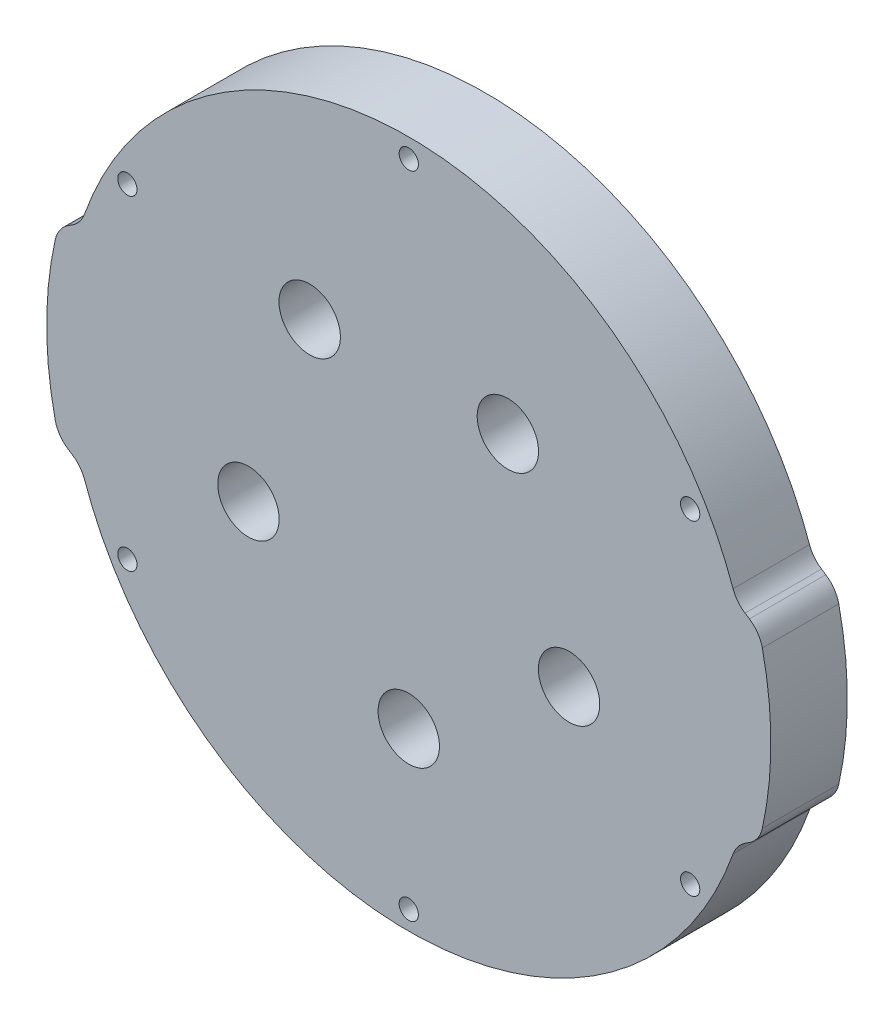
ISO-10303-21;
HEADER;
FILE_DESCRIPTION(('STEP AP214'),'2;1');
FILE_NAME('part.step','',(''),(''),'','','');
FILE_SCHEMA(('AUTOMOTIVE_DESIGN { 1 0 10303 214 1 1 1 1 }'));
ENDSEC;
DATA;
#1=APPLICATION_CONTEXT('core data for automotive mechanical design processes');
#2=APPLICATION_PROTOCOL_DEFINITION('international standard','automotive_design',2000,#1);
#3=PRODUCT_CONTEXT('',#1,'mechanical');
#4=PRODUCT('Part','Part','',(#3));
#5=PRODUCT_RELATED_PRODUCT_CATEGORY('part','',(#4));
#6=PRODUCT_DEFINITION_FORMATION('','',#4);
#7=PRODUCT_DEFINITION_CONTEXT('part definition',#1,'design');
#8=PRODUCT_DEFINITION('design','',#6,#7);
#9=PRODUCT_DEFINITION_SHAPE('','',#8);
#10=(LENGTH_UNIT() NAMED_UNIT(*) SI_UNIT(.MILLI.,.METRE.));
#11=(NAMED_UNIT(*) PLANE_ANGLE_UNIT() SI_UNIT($,.RADIAN.));
#12=(NAMED_UNIT(*) SI_UNIT($,.STERADIAN.) SOLID_ANGLE_UNIT());
#13=UNCERTAINTY_MEASURE_WITH_UNIT(LENGTH_MEASURE(1.E-05),#10,'distance_accuracy_value','');
#14=(GEOMETRIC_REPRESENTATION_CONTEXT(3) GLOBAL_UNCERTAINTY_ASSIGNED_CONTEXT((#13)) GLOBAL_UNIT_ASSIGNED_CONTEXT((#10,
#11,#12)) REPRESENTATION_CONTEXT('',''));
#15=CARTESIAN_POINT('',(0.,0.,0.));
#16=DIRECTION('',(0.,0.,1.));
#17=DIRECTION('',(1.,0.,0.));
#18=AXIS2_PLACEMENT_3D('',#15,#16,#17);
#19=CARTESIAN_POINT('',(0.,0.,12.7));
#20=DIRECTION('',(0.,0.,1.));
#21=DIRECTION('',(1.,0.,0.));
#22=AXIS2_PLACEMENT_3D('',#19,#20,#21);
#23=PLANE('',#22);
#24=CARTESIAN_POINT('',(0.,-28.,12.7));
#25=DIRECTION('',(0.,0.,-1.));
#26=DIRECTION('',(-1.,0.,0.));
#27=AXIS2_PLACEMENT_3D('',#24,#25,#26);
#28=CIRCLE('',#27,5.10000000000001);
#29=CARTESIAN_POINT('',(-5.10000000000001,-28.,12.7));
#30=VERTEX_POINT('',#29);
#31=EDGE_CURVE('E496',#30,#30,#28,.T.);
#32=ORIENTED_EDGE('',*,*,#31,.T.);
#33=EDGE_LOOP('',(#32));
#34=FACE_BOUND('',#33,.T.);
#35=CARTESIAN_POINT('',(16.4579870641893,22.6524758424985,12.7));
#36=DIRECTION('',(0.,0.,-1.));
#37=DIRECTION('',(-1.,0.,0.));
#38=AXIS2_PLACEMENT_3D('',#35,#36,#37);
#39=CIRCLE('',#38,5.1);
#40=CARTESIAN_POINT('',(11.3579870641893,22.6524758424985,12.7));
#41=VERTEX_POINT('',#40);
#42=EDGE_CURVE('E490',#41,#41,#39,.T.);
#43=ORIENTED_EDGE('',*,*,#42,.T.);
#44=EDGE_LOOP('',(#43));
#45=FACE_BOUND('',#44,.T.);
#46=CARTESIAN_POINT('',(-26.6295824562643,-8.65247584249852,12.7));
#47=DIRECTION('',(0.,0.,-1.));
#48=DIRECTION('',(-1.,0.,0.));
#49=AXIS2_PLACEMENT_3D('',#46,#47,#48);
#50=CIRCLE('',#49,5.1);
#51=CARTESIAN_POINT('',(-31.7295824562643,-8.65247584249852,12.7));
#52=VERTEX_POINT('',#51);
#53=EDGE_CURVE('E484',#52,#52,#50,.T.);
#54=ORIENTED_EDGE('',*,*,#53,.T.);
#55=EDGE_LOOP('',(#54));
#56=FACE_BOUND('',#55,.T.);
#57=CARTESIAN_POINT('',(26.6295824562643,-8.65247584249853,12.7));
#58=DIRECTION('',(0.,0.,-1.));
#59=DIRECTION('',(-1.,0.,0.));
#60=AXIS2_PLACEMENT_3D('',#57,#58,#59);
#61=CIRCLE('',#60,5.1);
#62=CARTESIAN_POINT('',(21.5295824562643,-8.65247584249853,12.7));
#63=VERTEX_POINT('',#62);
#64=EDGE_CURVE('E478',#63,#63,#61,.T.);
#65=ORIENTED_EDGE('',*,*,#64,.T.);
#66=EDGE_LOOP('',(#65));
#67=FACE_BOUND('',#66,.T.);
#68=CARTESIAN_POINT('',(-16.4579870641892,22.6524758424985,12.7));
#69=DIRECTION('',(0.,0.,-1.));
#70=DIRECTION('',(-1.,0.,0.));
#71=AXIS2_PLACEMENT_3D('',#68,#69,#70);
#72=CIRCLE('',#71,5.1);
#73=CARTESIAN_POINT('',(-21.5579870641892,22.6524758424985,12.7));
#74=VERTEX_POINT('',#73);
#75=EDGE_CURVE('E472',#74,#74,#72,.T.);
#76=ORIENTED_EDGE('',*,*,#75,.T.);
#77=EDGE_LOOP('',(#76));
#78=FACE_BOUND('',#77,.T.);
#79=CARTESIAN_POINT('',(4.05749188327836E-12,-53.9749999999976,12.7));
#80=DIRECTION('',(0.,0.,1.));
#81=DIRECTION('',(1.,0.,0.));
#82=AXIS2_PLACEMENT_3D('',#79,#80,#81);
#83=CIRCLE('',#82,1.6);
#84=CARTESIAN_POINT('',(1.60000000000406,-53.9749999999976,12.7));
#85=VERTEX_POINT('',#84);
#86=EDGE_CURVE('E460',#85,#85,#83,.T.);
#87=ORIENTED_EDGE('',*,*,#86,.F.);
#88=EDGE_LOOP('',(#87));
#89=FACE_BOUND('',#88,.T.);
#90=CARTESIAN_POINT('',(46.7437211692651,26.9875000000024,12.7));
#91=DIRECTION('',(0.,0.,1.));
#92=DIRECTION('',(1.,0.,0.));
#93=AXIS2_PLACEMENT_3D('',#90,#91,#92);
#94=CIRCLE('',#93,1.6);
#95=CARTESIAN_POINT('',(48.343721169265,26.9875000000024,12.7));
#96=VERTEX_POINT('',#95);
#97=EDGE_CURVE('E438',#96,#96,#94,.T.);
#98=ORIENTED_EDGE('',*,*,#97,.F.);
#99=EDGE_LOOP('',(#98));
#100=FACE_BOUND('',#99,.T.);
#101=CARTESIAN_POINT('',(0.,53.975,12.7));
#102=DIRECTION('',(0.,0.,1.));
#103=DIRECTION('',(1.,0.,0.));
#104=AXIS2_PLACEMENT_3D('',#101,#102,#103);
#105=CIRCLE('',#104,1.6);
#106=CARTESIAN_POINT('',(1.6,53.975,12.7));
#107=VERTEX_POINT('',#106);
#108=EDGE_CURVE('E253',#107,#107,#105,.T.);
#109=ORIENTED_EDGE('',*,*,#108,.F.);
#110=EDGE_LOOP('',(#109));
#111=FACE_BOUND('',#110,.T.);
#112=DIRECTION('',(0.83836541006885,0.545108648986685,0.));
#113=VECTOR('',#112,1.);
#114=CARTESIAN_POINT('',(54.4047102740195,-17.5,12.7));
#115=LINE('',#114,#113);
#116=CARTESIAN_POINT('',(55.8597455361239,-16.5539300686456,12.7));
#117=VERTEX_POINT('',#116);
#118=CARTESIAN_POINT('',(56.5773734681787,-16.0873254260645,12.7));
#119=VERTEX_POINT('',#118);
#120=EDGE_CURVE('E278',#117,#119,#115,.T.);
#121=ORIENTED_EDGE('',*,*,#120,.T.);
#122=CARTESIAN_POINT('',(53.8518302232453,-11.8954983757203,12.7));
#123=DIRECTION('',(0.,0.,1.));
#124=DIRECTION('',(1.,0.,0.));
#125=AXIS2_PLACEMENT_3D('',#122,#123,#124);
#126=CIRCLE('',#125,5.);
#127=CARTESIAN_POINT('',(58.7341357738568,-12.97396604351,12.7));
#128=VERTEX_POINT('',#127);
#129=EDGE_CURVE('E197',#119,#128,#126,.T.);
#130=ORIENTED_EDGE('',*,*,#129,.T.);
#131=CARTESIAN_POINT('',(0.,0.,12.7));
#132=DIRECTION('',(0.,0.,1.));
#133=DIRECTION('',(1.,0.,0.));
#134=AXIS2_PLACEMENT_3D('',#131,#132,#133);
#135=CIRCLE('',#134,60.15);
#136=CARTESIAN_POINT('',(58.7341357738568,12.97396604351,12.7));
#137=VERTEX_POINT('',#136);
#138=EDGE_CURVE('E167',#128,#137,#135,.T.);
#139=ORIENTED_EDGE('',*,*,#138,.T.);
#140=CARTESIAN_POINT('',(53.8518302232453,11.8954983757203,12.7));
#141=DIRECTION('',(0.,0.,1.));
#142=DIRECTION('',(1.,0.,0.));
#143=AXIS2_PLACEMENT_3D('',#140,#141,#142);
#144=CIRCLE('',#143,5.);
#145=CARTESIAN_POINT('',(56.5773734681787,16.0873254260645,12.7));
#146=VERTEX_POINT('',#145);
#147=EDGE_CURVE('E56',#137,#146,#144,.T.);
#148=ORIENTED_EDGE('',*,*,#147,.T.);
#149=DIRECTION('',(-0.83836541006885,0.545108648986684,0.));
#150=VECTOR('',#149,1.);
#151=CARTESIAN_POINT('',(54.4047102740195,17.5,12.7));
#152=LINE('',#151,#150);
#153=CARTESIAN_POINT('',(55.8597455361239,16.5539300686456,12.7));
#154=VERTEX_POINT('',#153);
#155=EDGE_CURVE('E183',#146,#154,#152,.T.);
#156=ORIENTED_EDGE('',*,*,#155,.T.);
#157=CARTESIAN_POINT('',(58.5852887810573,20.7457571189899,12.7));
#158=DIRECTION('',(0.,0.,1.));
#159=DIRECTION('',(1.,0.,0.));
#160=AXIS2_PLACEMENT_3D('',#157,#158,#159);
#161=CIRCLE('',#160,5.);
#162=CARTESIAN_POINT('',(53.87207166271,19.0767501102216,12.7));
#163=VERTEX_POINT('',#162);
#164=EDGE_CURVE('E234',#154,#163,#161,.F.);
#165=ORIENTED_EDGE('',*,*,#164,.T.);
#166=CARTESIAN_POINT('',(0.,0.,12.7));
#167=DIRECTION('',(0.,0.,1.));
#168=DIRECTION('',(1.,0.,0.));
#169=AXIS2_PLACEMENT_3D('',#166,#167,#168);
#170=CIRCLE('',#169,57.15);
#171=CARTESIAN_POINT('',(-53.87207166271,19.0767501102216,12.7));
#172=VERTEX_POINT('',#171);
#173=EDGE_CURVE('E177',#163,#172,#170,.T.);
#174=ORIENTED_EDGE('',*,*,#173,.T.);
#175=CARTESIAN_POINT('',(-58.5852887810573,20.7457571189899,12.7));
#176=DIRECTION('',(0.,0.,1.));
#177=DIRECTION('',(1.,0.,0.));
#178=AXIS2_PLACEMENT_3D('',#175,#176,#177);
#179=CIRCLE('',#178,5.);
#180=CARTESIAN_POINT('',(-55.8597455361239,16.5539300686456,12.7));
#181=VERTEX_POINT('',#180);
#182=EDGE_CURVE('E11',#172,#181,#179,.F.);
#183=ORIENTED_EDGE('',*,*,#182,.T.);
#184=DIRECTION('',(-0.83836541006885,-0.545108648986684,0.));
#185=VECTOR('',#184,1.);
#186=CARTESIAN_POINT('',(-54.4047102740195,17.5,12.7));
#187=LINE('',#186,#185);
#188=CARTESIAN_POINT('',(-56.5773734681787,16.0873254260645,12.7));
#189=VERTEX_POINT('',#188);
#190=EDGE_CURVE('E260',#181,#189,#187,.T.);
#191=ORIENTED_EDGE('',*,*,#190,.T.);
#192=CARTESIAN_POINT('',(-53.8518302232453,11.8954983757203,12.7));
#193=DIRECTION('',(0.,0.,1.));
#194=DIRECTION('',(1.,0.,0.));
#195=AXIS2_PLACEMENT_3D('',#192,#193,#194);
#196=CIRCLE('',#195,5.);
#197=CARTESIAN_POINT('',(-58.7341357738568,12.97396604351,12.7));
#198=VERTEX_POINT('',#197);
#199=EDGE_CURVE('E192',#189,#198,#196,.T.);
#200=ORIENTED_EDGE('',*,*,#199,.T.);
#201=CARTESIAN_POINT('',(0.,0.,12.7));
#202=DIRECTION('',(0.,0.,1.));
#203=DIRECTION('',(1.,0.,0.));
#204=AXIS2_PLACEMENT_3D('',#201,#202,#203);
#205=CIRCLE('',#204,60.15);
#206=CARTESIAN_POINT('',(-58.7341357738568,-12.97396604351,12.7));
#207=VERTEX_POINT('',#206);
#208=EDGE_CURVE('E265',#198,#207,#205,.T.);
#209=ORIENTED_EDGE('',*,*,#208,.T.);
#210=CARTESIAN_POINT('',(-53.8518302232453,-11.8954983757203,12.7));
#211=DIRECTION('',(0.,0.,1.));
#212=DIRECTION('',(1.,0.,0.));
#213=AXIS2_PLACEMENT_3D('',#210,#211,#212);
#214=CIRCLE('',#213,5.);
#215=CARTESIAN_POINT('',(-56.5773734681787,-16.0873254260645,12.7));
#216=VERTEX_POINT('',#215);
#217=EDGE_CURVE('E194',#207,#216,#214,.T.);
#218=ORIENTED_EDGE('',*,*,#217,.T.);
#219=DIRECTION('',(0.83836541006885,-0.545108648986684,0.));
#220=VECTOR('',#219,1.);
#221=CARTESIAN_POINT('',(-54.4047102740195,-17.5,12.7));
#222=LINE('',#221,#220);
#223=CARTESIAN_POINT('',(-55.8597455361239,-16.5539300686456,12.7));
#224=VERTEX_POINT('',#223);
#225=EDGE_CURVE('E268',#216,#224,#222,.T.);
#226=ORIENTED_EDGE('',*,*,#225,.T.);
#227=CARTESIAN_POINT('',(-58.5852887810573,-20.7457571189899,12.7));
#228=DIRECTION('',(0.,0.,1.));
#229=DIRECTION('',(1.,0.,0.));
#230=AXIS2_PLACEMENT_3D('',#227,#228,#229);
#231=CIRCLE('',#230,5.);
#232=CARTESIAN_POINT('',(-53.87207166271,-19.0767501102216,12.7));
#233=VERTEX_POINT('',#232);
#234=EDGE_CURVE('E238',#224,#233,#231,.F.);
#235=ORIENTED_EDGE('',*,*,#234,.T.);
#236=CARTESIAN_POINT('',(0.,0.,12.7));
#237=DIRECTION('',(0.,0.,1.));
#238=DIRECTION('',(1.,0.,0.));
#239=AXIS2_PLACEMENT_3D('',#236,#237,#238);
#240=CIRCLE('',#239,57.15);
#241=CARTESIAN_POINT('',(53.87207166271,-19.0767501102216,12.7));
#242=VERTEX_POINT('',#241);
#243=EDGE_CURVE('E275',#233,#242,#240,.T.);
#244=ORIENTED_EDGE('',*,*,#243,.T.);
#245=CARTESIAN_POINT('',(58.5852887810573,-20.7457571189899,12.7));
#246=DIRECTION('',(0.,0.,1.));
#247=DIRECTION('',(1.,0.,0.));
#248=AXIS2_PLACEMENT_3D('',#245,#246,#247);
#249=CIRCLE('',#248,5.);
#250=EDGE_CURVE('E230',#242,#117,#249,.F.);
#251=ORIENTED_EDGE('',*,*,#250,.T.);
#252=EDGE_LOOP('',(#121,#130,#139,#148,#156,#165,#174,#183,#191,#200,#209,#218,#226,#235,#244,#251));
#253=FACE_BOUND('',#252,.T.);
#254=CARTESIAN_POINT('',(-46.743721169261,-26.9875,12.7));
#255=DIRECTION('',(0.,0.,1.));
#256=DIRECTION('',(1.,0.,0.));
#257=AXIS2_PLACEMENT_3D('',#254,#255,#256);
#258=CIRCLE('',#257,1.6);
#259=CARTESIAN_POINT('',(-45.143721169261,-26.9875,12.7));
#260=VERTEX_POINT('',#259);
#261=EDGE_CURVE('E434',#260,#260,#258,.T.);
#262=ORIENTED_EDGE('',*,*,#261,.F.);
#263=EDGE_LOOP('',(#262));
#264=FACE_BOUND('',#263,.T.);
#265=CARTESIAN_POINT('',(46.7437211692671,-26.9874999999964,12.7));
#266=DIRECTION('',(0.,0.,1.));
#267=DIRECTION('',(1.,0.,0.));
#268=AXIS2_PLACEMENT_3D('',#265,#266,#267);
#269=CIRCLE('',#268,1.6);
#270=CARTESIAN_POINT('',(48.3437211692671,-26.9874999999964,12.7));
#271=VERTEX_POINT('',#270);
#272=EDGE_CURVE('E455',#271,#271,#269,.T.);
#273=ORIENTED_EDGE('',*,*,#272,.F.);
#274=EDGE_LOOP('',(#273));
#275=FACE_BOUND('',#274,.T.);
#276=CARTESIAN_POINT('',(-46.743721169263,26.9874999999988,12.7));
#277=DIRECTION('',(0.,0.,1.));
#278=DIRECTION('',(1.,0.,0.));
#279=AXIS2_PLACEMENT_3D('',#276,#277,#278);
#280=CIRCLE('',#279,1.6);
#281=CARTESIAN_POINT('',(-45.143721169263,26.9874999999988,12.7));
#282=VERTEX_POINT('',#281);
#283=EDGE_CURVE('E466',#282,#282,#280,.T.);
#284=ORIENTED_EDGE('',*,*,#283,.F.);
#285=EDGE_LOOP('',(#284));
#286=FACE_BOUND('',#285,.T.);
#287=ADVANCED_FACE('F34',(#34,#45,#56,#67,#78,#89,#100,#111,#253,#264,#275,#286),#23,.T.);
#288=CARTESIAN_POINT('',(0.,0.,0.));
#289=DIRECTION('',(0.,0.,1.));
#290=DIRECTION('',(1.,0.,0.));
#291=AXIS2_PLACEMENT_3D('',#288,#289,#290);
#292=PLANE('',#291);
#293=CARTESIAN_POINT('',(0.,-28.,0.));
#294=DIRECTION('',(0.,0.,-1.));
#295=DIRECTION('',(-1.,0.,0.));
#296=AXIS2_PLACEMENT_3D('',#293,#294,#295);
#297=CIRCLE('',#296,5.10000000000001);
#298=CARTESIAN_POINT('',(-5.10000000000001,-28.,0.));
#299=VERTEX_POINT('',#298);
#300=EDGE_CURVE('E499',#299,#299,#297,.T.);
#301=ORIENTED_EDGE('',*,*,#300,.F.);
#302=EDGE_LOOP('',(#301));
#303=FACE_BOUND('',#302,.T.);
#304=CARTESIAN_POINT('',(16.4579870641893,22.6524758424985,0.));
#305=DIRECTION('',(0.,0.,-1.));
#306=DIRECTION('',(-1.,0.,0.));
#307=AXIS2_PLACEMENT_3D('',#304,#305,#306);
#308=CIRCLE('',#307,5.1);
#309=CARTESIAN_POINT('',(11.3579870641893,22.6524758424985,0.));
#310=VERTEX_POINT('',#309);
#311=EDGE_CURVE('E493',#310,#310,#308,.T.);
#312=ORIENTED_EDGE('',*,*,#311,.F.);
#313=EDGE_LOOP('',(#312));
#314=FACE_BOUND('',#313,.T.);
#315=CARTESIAN_POINT('',(-26.6295824562643,-8.65247584249852,0.));
#316=DIRECTION('',(0.,0.,-1.));
#317=DIRECTION('',(-1.,0.,0.));
#318=AXIS2_PLACEMENT_3D('',#315,#316,#317);
#319=CIRCLE('',#318,5.1);
#320=CARTESIAN_POINT('',(-31.7295824562643,-8.65247584249852,0.));
#321=VERTEX_POINT('',#320);
#322=EDGE_CURVE('E487',#321,#321,#319,.T.);
#323=ORIENTED_EDGE('',*,*,#322,.F.);
#324=EDGE_LOOP('',(#323));
#325=FACE_BOUND('',#324,.T.);
#326=CARTESIAN_POINT('',(26.6295824562643,-8.65247584249853,0.));
#327=DIRECTION('',(0.,0.,-1.));
#328=DIRECTION('',(-1.,0.,0.));
#329=AXIS2_PLACEMENT_3D('',#326,#327,#328);
#330=CIRCLE('',#329,5.1);
#331=CARTESIAN_POINT('',(21.5295824562643,-8.65247584249853,0.));
#332=VERTEX_POINT('',#331);
#333=EDGE_CURVE('E481',#332,#332,#330,.T.);
#334=ORIENTED_EDGE('',*,*,#333,.F.);
#335=EDGE_LOOP('',(#334));
#336=FACE_BOUND('',#335,.T.);
#337=CARTESIAN_POINT('',(-16.4579870641892,22.6524758424985,0.));
#338=DIRECTION('',(0.,0.,-1.));
#339=DIRECTION('',(-1.,0.,0.));
#340=AXIS2_PLACEMENT_3D('',#337,#338,#339);
#341=CIRCLE('',#340,5.1);
#342=CARTESIAN_POINT('',(-21.5579870641892,22.6524758424985,0.));
#343=VERTEX_POINT('',#342);
#344=EDGE_CURVE('E475',#343,#343,#341,.T.);
#345=ORIENTED_EDGE('',*,*,#344,.F.);
#346=EDGE_LOOP('',(#345));
#347=FACE_BOUND('',#346,.T.);
#348=CARTESIAN_POINT('',(4.05749188327836E-12,-53.9749999999976,0.));
#349=DIRECTION('',(0.,0.,1.));
#350=DIRECTION('',(1.,0.,0.));
#351=AXIS2_PLACEMENT_3D('',#348,#349,#350);
#352=CIRCLE('',#351,1.6);
#353=CARTESIAN_POINT('',(1.60000000000406,-53.9749999999976,0.));
#354=VERTEX_POINT('',#353);
#355=EDGE_CURVE('E463',#354,#354,#352,.T.);
#356=ORIENTED_EDGE('',*,*,#355,.T.);
#357=EDGE_LOOP('',(#356));
#358=FACE_BOUND('',#357,.T.);
#359=CARTESIAN_POINT('',(46.7437211692651,26.9875000000024,0.));
#360=DIRECTION('',(0.,0.,1.));
#361=DIRECTION('',(1.,0.,0.));
#362=AXIS2_PLACEMENT_3D('',#359,#360,#361);
#363=CIRCLE('',#362,1.6);
#364=CARTESIAN_POINT('',(48.343721169265,26.9875000000024,0.));
#365=VERTEX_POINT('',#364);
#366=EDGE_CURVE('E443',#365,#365,#363,.T.);
#367=ORIENTED_EDGE('',*,*,#366,.T.);
#368=EDGE_LOOP('',(#367));
#369=FACE_BOUND('',#368,.T.);
#370=CARTESIAN_POINT('',(0.,53.975,0.));
#371=DIRECTION('',(0.,0.,1.));
#372=DIRECTION('',(1.,0.,0.));
#373=AXIS2_PLACEMENT_3D('',#370,#371,#372);
#374=CIRCLE('',#373,1.6);
#375=CARTESIAN_POINT('',(1.6,53.975,0.));
#376=VERTEX_POINT('',#375);
#377=EDGE_CURVE('E440',#376,#376,#374,.T.);
#378=ORIENTED_EDGE('',*,*,#377,.T.);
#379=EDGE_LOOP('',(#378));
#380=FACE_BOUND('',#379,.T.);
#381=CARTESIAN_POINT('',(0.,0.,0.));
#382=DIRECTION('',(0.,0.,1.));
#383=DIRECTION('',(1.,0.,0.));
#384=AXIS2_PLACEMENT_3D('',#381,#382,#383);
#385=CIRCLE('',#384,60.15);
#386=CARTESIAN_POINT('',(58.7341357738568,-12.97396604351,0.));
#387=VERTEX_POINT('',#386);
#388=CARTESIAN_POINT('',(58.7341357738568,12.97396604351,0.));
#389=VERTEX_POINT('',#388);
#390=EDGE_CURVE('E165',#387,#389,#385,.T.);
#391=ORIENTED_EDGE('',*,*,#390,.F.);
#392=CARTESIAN_POINT('',(53.8518302232453,-11.8954983757203,0.));
#393=DIRECTION('',(0.,0.,1.));
#394=DIRECTION('',(1.,0.,0.));
#395=AXIS2_PLACEMENT_3D('',#392,#393,#394);
#396=CIRCLE('',#395,5.);
#397=CARTESIAN_POINT('',(56.5773734681787,-16.0873254260645,0.));
#398=VERTEX_POINT('',#397);
#399=EDGE_CURVE('E148',#387,#398,#396,.F.);
#400=ORIENTED_EDGE('',*,*,#399,.T.);
#401=DIRECTION('',(0.83836541006885,0.545108648986685,0.));
#402=VECTOR('',#401,1.);
#403=CARTESIAN_POINT('',(54.4047102740195,-17.5,0.));
#404=LINE('',#403,#402);
#405=CARTESIAN_POINT('',(55.8597455361239,-16.5539300686456,0.));
#406=VERTEX_POINT('',#405);
#407=EDGE_CURVE('E175',#406,#398,#404,.T.);
#408=ORIENTED_EDGE('',*,*,#407,.F.);
#409=CARTESIAN_POINT('',(58.5852887810573,-20.7457571189899,0.));
#410=DIRECTION('',(0.,0.,1.));
#411=DIRECTION('',(1.,0.,0.));
#412=AXIS2_PLACEMENT_3D('',#409,#410,#411);
#413=CIRCLE('',#412,5.);
#414=CARTESIAN_POINT('',(53.87207166271,-19.0767501102216,0.));
#415=VERTEX_POINT('',#414);
#416=EDGE_CURVE('E228',#406,#415,#413,.T.);
#417=ORIENTED_EDGE('',*,*,#416,.T.);
#418=CARTESIAN_POINT('',(0.,0.,0.));
#419=DIRECTION('',(0.,0.,1.));
#420=DIRECTION('',(1.,0.,0.));
#421=AXIS2_PLACEMENT_3D('',#418,#419,#420);
#422=CIRCLE('',#421,57.15);
#423=CARTESIAN_POINT('',(-53.87207166271,-19.0767501102216,0.));
#424=VERTEX_POINT('',#423);
#425=EDGE_CURVE('E179',#424,#415,#422,.T.);
#426=ORIENTED_EDGE('',*,*,#425,.F.);
#427=CARTESIAN_POINT('',(-58.5852887810573,-20.7457571189899,0.));
#428=DIRECTION('',(0.,0.,1.));
#429=DIRECTION('',(1.,0.,0.));
#430=AXIS2_PLACEMENT_3D('',#427,#428,#429);
#431=CIRCLE('',#430,5.);
#432=CARTESIAN_POINT('',(-55.8597455361239,-16.5539300686456,0.));
#433=VERTEX_POINT('',#432);
#434=EDGE_CURVE('E236',#424,#433,#431,.T.);
#435=ORIENTED_EDGE('',*,*,#434,.T.);
#436=DIRECTION('',(0.83836541006885,-0.545108648986684,0.));
#437=VECTOR('',#436,1.);
#438=CARTESIAN_POINT('',(-54.4047102740195,-17.5,0.));
#439=LINE('',#438,#437);
#440=CARTESIAN_POINT('',(-56.5773734681787,-16.0873254260645,0.));
#441=VERTEX_POINT('',#440);
#442=EDGE_CURVE('E286',#441,#433,#439,.T.);
#443=ORIENTED_EDGE('',*,*,#442,.F.);
#444=CARTESIAN_POINT('',(-53.8518302232453,-11.8954983757203,0.));
#445=DIRECTION('',(0.,0.,1.));
#446=DIRECTION('',(1.,0.,0.));
#447=AXIS2_PLACEMENT_3D('',#444,#445,#446);
#448=CIRCLE('',#447,5.);
#449=CARTESIAN_POINT('',(-58.7341357738568,-12.97396604351,0.));
#450=VERTEX_POINT('',#449);
#451=EDGE_CURVE('E186',#441,#450,#448,.F.);
#452=ORIENTED_EDGE('',*,*,#451,.T.);
#453=CARTESIAN_POINT('',(0.,0.,0.));
#454=DIRECTION('',(0.,0.,1.));
#455=DIRECTION('',(1.,0.,0.));
#456=AXIS2_PLACEMENT_3D('',#453,#454,#455);
#457=CIRCLE('',#456,60.15);
#458=CARTESIAN_POINT('',(-58.7341357738568,12.97396604351,0.));
#459=VERTEX_POINT('',#458);
#460=EDGE_CURVE('E283',#459,#450,#457,.T.);
#461=ORIENTED_EDGE('',*,*,#460,.F.);
#462=CARTESIAN_POINT('',(-53.8518302232453,11.8954983757203,0.));
#463=DIRECTION('',(0.,0.,1.));
#464=DIRECTION('',(1.,0.,0.));
#465=AXIS2_PLACEMENT_3D('',#462,#463,#464);
#466=CIRCLE('',#465,5.);
#467=CARTESIAN_POINT('',(-56.5773734681787,16.0873254260645,0.));
#468=VERTEX_POINT('',#467);
#469=EDGE_CURVE('E168',#459,#468,#466,.F.);
#470=ORIENTED_EDGE('',*,*,#469,.T.);
#471=DIRECTION('',(-0.83836541006885,-0.545108648986684,0.));
#472=VECTOR('',#471,1.);
#473=CARTESIAN_POINT('',(-54.4047102740195,17.5,0.));
#474=LINE('',#473,#472);
#475=CARTESIAN_POINT('',(-55.8597455361239,16.5539300686456,0.));
#476=VERTEX_POINT('',#475);
#477=EDGE_CURVE('E244',#476,#468,#474,.T.);
#478=ORIENTED_EDGE('',*,*,#477,.F.);
#479=CARTESIAN_POINT('',(-58.5852887810573,20.7457571189899,0.));
#480=DIRECTION('',(0.,0.,1.));
#481=DIRECTION('',(1.,0.,0.));
#482=AXIS2_PLACEMENT_3D('',#479,#480,#481);
#483=CIRCLE('',#482,5.);
#484=CARTESIAN_POINT('',(-53.87207166271,19.0767501102216,0.));
#485=VERTEX_POINT('',#484);
#486=EDGE_CURVE('E42',#476,#485,#483,.T.);
#487=ORIENTED_EDGE('',*,*,#486,.T.);
#488=CARTESIAN_POINT('',(0.,0.,0.));
#489=DIRECTION('',(0.,0.,1.));
#490=DIRECTION('',(1.,0.,0.));
#491=AXIS2_PLACEMENT_3D('',#488,#489,#490);
#492=CIRCLE('',#491,57.15);
#493=CARTESIAN_POINT('',(53.87207166271,19.0767501102216,0.));
#494=VERTEX_POINT('',#493);
#495=EDGE_CURVE('E242',#494,#485,#492,.T.);
#496=ORIENTED_EDGE('',*,*,#495,.F.);
#497=CARTESIAN_POINT('',(58.5852887810573,20.7457571189899,0.));
#498=DIRECTION('',(0.,0.,1.));
#499=DIRECTION('',(1.,0.,0.));
#500=AXIS2_PLACEMENT_3D('',#497,#498,#499);
#501=CIRCLE('',#500,5.);
#502=CARTESIAN_POINT('',(55.8597455361239,16.5539300686456,0.));
#503=VERTEX_POINT('',#502);
#504=EDGE_CURVE('E232',#494,#503,#501,.T.);
#505=ORIENTED_EDGE('',*,*,#504,.T.);
#506=DIRECTION('',(-0.83836541006885,0.545108648986684,0.));
#507=VECTOR('',#506,1.);
#508=CARTESIAN_POINT('',(54.4047102740195,17.5,0.));
#509=LINE('',#508,#507);
#510=CARTESIAN_POINT('',(56.5773734681787,16.0873254260645,0.));
#511=VERTEX_POINT('',#510);
#512=EDGE_CURVE('E174',#511,#503,#509,.T.);
#513=ORIENTED_EDGE('',*,*,#512,.F.);
#514=CARTESIAN_POINT('',(53.8518302232453,11.8954983757203,0.));
#515=DIRECTION('',(0.,0.,1.));
#516=DIRECTION('',(1.,0.,0.));
#517=AXIS2_PLACEMENT_3D('',#514,#515,#516);
#518=CIRCLE('',#517,5.);
#519=EDGE_CURVE('E159',#511,#389,#518,.F.);
#520=ORIENTED_EDGE('',*,*,#519,.T.);
#521=EDGE_LOOP('',(#391,#400,#408,#417,#426,#435,#443,#452,#461,#470,#478,#487,#496,#505,#513,#520));
#522=FACE_BOUND('',#521,.T.);
#523=CARTESIAN_POINT('',(-46.743721169261,-26.9875,0.));
#524=DIRECTION('',(0.,0.,1.));
#525=DIRECTION('',(1.,0.,0.));
#526=AXIS2_PLACEMENT_3D('',#523,#524,#525);
#527=CIRCLE('',#526,1.6);
#528=CARTESIAN_POINT('',(-45.143721169261,-26.9875,0.));
#529=VERTEX_POINT('',#528);
#530=EDGE_CURVE('E437',#529,#529,#527,.T.);
#531=ORIENTED_EDGE('',*,*,#530,.T.);
#532=EDGE_LOOP('',(#531));
#533=FACE_BOUND('',#532,.T.);
#534=CARTESIAN_POINT('',(46.7437211692671,-26.9874999999964,0.));
#535=DIRECTION('',(0.,0.,1.));
#536=DIRECTION('',(1.,0.,0.));
#537=AXIS2_PLACEMENT_3D('',#534,#535,#536);
#538=CIRCLE('',#537,1.6);
#539=CARTESIAN_POINT('',(48.3437211692671,-26.9874999999964,0.));
#540=VERTEX_POINT('',#539);
#541=EDGE_CURVE('E457',#540,#540,#538,.T.);
#542=ORIENTED_EDGE('',*,*,#541,.T.);
#543=EDGE_LOOP('',(#542));
#544=FACE_BOUND('',#543,.T.);
#545=CARTESIAN_POINT('',(-46.743721169263,26.9874999999988,0.));
#546=DIRECTION('',(0.,0.,1.));
#547=DIRECTION('',(1.,0.,0.));
#548=AXIS2_PLACEMENT_3D('',#545,#546,#547);
#549=CIRCLE('',#548,1.6);
#550=CARTESIAN_POINT('',(-45.143721169263,26.9874999999988,0.));
#551=VERTEX_POINT('',#550);
#552=EDGE_CURVE('E469',#551,#551,#549,.T.);
#553=ORIENTED_EDGE('',*,*,#552,.T.);
#554=EDGE_LOOP('',(#553));
#555=FACE_BOUND('',#554,.T.);
#556=ADVANCED_FACE('F171',(#303,#314,#325,#336,#347,#358,#369,#380,#522,#533,#544,#555),#292,.F.);
#557=CARTESIAN_POINT('',(0.,0.,12.7));
#558=DIRECTION('',(0.,0.,-1.));
#559=DIRECTION('',(-1.,0.,0.));
#560=AXIS2_PLACEMENT_3D('',#557,#558,#559);
#561=CYLINDRICAL_SURFACE('',#560,57.15);
#562=ORIENTED_EDGE('',*,*,#173,.F.);
#563=DIRECTION('',(0.,0.,-1.));
#564=VECTOR('',#563,1.);
#565=CARTESIAN_POINT('',(53.87207166271,19.0767501102216,12.7));
#566=LINE('',#565,#564);
#567=EDGE_CURVE('E210',#163,#494,#566,.T.);
#568=ORIENTED_EDGE('',*,*,#567,.T.);
#569=ORIENTED_EDGE('',*,*,#495,.T.);
#570=DIRECTION('',(0.,0.,-1.));
#571=VECTOR('',#570,1.);
#572=CARTESIAN_POINT('',(-53.87207166271,19.0767501102216,12.7));
#573=LINE('',#572,#571);
#574=EDGE_CURVE('E208',#485,#172,#573,.F.);
#575=ORIENTED_EDGE('',*,*,#574,.T.);
#576=EDGE_LOOP('',(#562,#568,#569,#575));
#577=FACE_BOUND('',#576,.T.);
#578=ADVANCED_FACE('F250',(#577),#561,.T.);
#579=CARTESIAN_POINT('',(-54.4047102740195,17.5,12.7));
#580=DIRECTION('',(0.545108648986685,-0.83836541006885,0.));
#581=DIRECTION('',(0.83836541006885,0.545108648986685,0.));
#582=AXIS2_PLACEMENT_3D('',#579,#580,#581);
#583=PLANE('',#582);
#584=ORIENTED_EDGE('',*,*,#477,.T.);
#585=DIRECTION('',(0.,0.,-1.));
#586=VECTOR('',#585,1.);
#587=CARTESIAN_POINT('',(-56.5773734681787,16.0873254260645,12.7));
#588=LINE('',#587,#586);
#589=EDGE_CURVE('E226',#468,#189,#588,.F.);
#590=ORIENTED_EDGE('',*,*,#589,.T.);
#591=ORIENTED_EDGE('',*,*,#190,.F.);
#592=DIRECTION('',(0.,0.,1.));
#593=VECTOR('',#592,1.);
#594=CARTESIAN_POINT('',(-55.8597455361239,16.5539300686456,0.));
#595=LINE('',#594,#593);
#596=EDGE_CURVE('E223',#181,#476,#595,.F.);
#597=ORIENTED_EDGE('',*,*,#596,.T.);
#598=EDGE_LOOP('',(#584,#590,#591,#597));
#599=FACE_BOUND('',#598,.T.);
#600=ADVANCED_FACE('F263',(#599),#583,.F.);
#601=CARTESIAN_POINT('',(0.,0.,12.7));
#602=DIRECTION('',(0.,0.,-1.));
#603=DIRECTION('',(-1.,0.,0.));
#604=AXIS2_PLACEMENT_3D('',#601,#602,#603);
#605=CYLINDRICAL_SURFACE('',#604,60.15);
#606=ORIENTED_EDGE('',*,*,#460,.T.);
#607=DIRECTION('',(0.,0.,-1.));
#608=VECTOR('',#607,1.);
#609=CARTESIAN_POINT('',(-58.7341357738568,-12.97396604351,12.7));
#610=LINE('',#609,#608);
#611=EDGE_CURVE('E221',#450,#207,#610,.F.);
#612=ORIENTED_EDGE('',*,*,#611,.T.);
#613=ORIENTED_EDGE('',*,*,#208,.F.);
#614=DIRECTION('',(0.,0.,-1.));
#615=VECTOR('',#614,1.);
#616=CARTESIAN_POINT('',(-58.7341357738568,12.97396604351,12.7));
#617=LINE('',#616,#615);
#618=EDGE_CURVE('E218',#198,#459,#617,.T.);
#619=ORIENTED_EDGE('',*,*,#618,.T.);
#620=EDGE_LOOP('',(#606,#612,#613,#619));
#621=FACE_BOUND('',#620,.T.);
#622=ADVANCED_FACE('F365',(#621),#605,.T.);
#623=CARTESIAN_POINT('',(-54.4047102740195,-17.5,12.7));
#624=DIRECTION('',(0.545108648986685,0.83836541006885,0.));
#625=DIRECTION('',(-0.83836541006885,0.545108648986685,0.));
#626=AXIS2_PLACEMENT_3D('',#623,#624,#625);
#627=PLANE('',#626);
#628=ORIENTED_EDGE('',*,*,#442,.T.);
#629=DIRECTION('',(0.,0.,1.));
#630=VECTOR('',#629,1.);
#631=CARTESIAN_POINT('',(-55.8597455361239,-16.5539300686456,12.7));
#632=LINE('',#631,#630);
#633=EDGE_CURVE('E216',#433,#224,#632,.T.);
#634=ORIENTED_EDGE('',*,*,#633,.T.);
#635=ORIENTED_EDGE('',*,*,#225,.F.);
#636=DIRECTION('',(0.,0.,-1.));
#637=VECTOR('',#636,1.);
#638=CARTESIAN_POINT('',(-56.5773734681787,-16.0873254260645,12.7));
#639=LINE('',#638,#637);
#640=EDGE_CURVE('E213',#216,#441,#639,.T.);
#641=ORIENTED_EDGE('',*,*,#640,.T.);
#642=EDGE_LOOP('',(#628,#634,#635,#641));
#643=FACE_BOUND('',#642,.T.);
#644=ADVANCED_FACE('F310',(#643),#627,.F.);
#645=CARTESIAN_POINT('',(0.,0.,12.7));
#646=DIRECTION('',(0.,0.,-1.));
#647=DIRECTION('',(-1.,0.,0.));
#648=AXIS2_PLACEMENT_3D('',#645,#646,#647);
#649=CYLINDRICAL_SURFACE('',#648,57.15);
#650=ORIENTED_EDGE('',*,*,#425,.T.);
#651=DIRECTION('',(0.,0.,-1.));
#652=VECTOR('',#651,1.);
#653=CARTESIAN_POINT('',(53.87207166271,-19.0767501102216,12.7));
#654=LINE('',#653,#652);
#655=EDGE_CURVE('E202',#415,#242,#654,.F.);
#656=ORIENTED_EDGE('',*,*,#655,.T.);
#657=ORIENTED_EDGE('',*,*,#243,.F.);
#658=DIRECTION('',(0.,0.,-1.));
#659=VECTOR('',#658,1.);
#660=CARTESIAN_POINT('',(-53.87207166271,-19.0767501102216,12.7));
#661=LINE('',#660,#659);
#662=EDGE_CURVE('E199',#233,#424,#661,.T.);
#663=ORIENTED_EDGE('',*,*,#662,.T.);
#664=EDGE_LOOP('',(#650,#656,#657,#663));
#665=FACE_BOUND('',#664,.T.);
#666=ADVANCED_FACE('F292',(#665),#649,.T.);
#667=CARTESIAN_POINT('',(54.4047102740195,-17.5,12.7));
#668=DIRECTION('',(-0.545108648986685,0.83836541006885,0.));
#669=DIRECTION('',(-0.83836541006885,-0.545108648986685,0.));
#670=AXIS2_PLACEMENT_3D('',#667,#668,#669);
#671=PLANE('',#670);
#672=ORIENTED_EDGE('',*,*,#407,.T.);
#673=DIRECTION('',(0.,0.,-1.));
#674=VECTOR('',#673,1.);
#675=CARTESIAN_POINT('',(56.5773734681787,-16.0873254260645,12.7));
#676=LINE('',#675,#674);
#677=EDGE_CURVE('E153',#398,#119,#676,.F.);
#678=ORIENTED_EDGE('',*,*,#677,.T.);
#679=ORIENTED_EDGE('',*,*,#120,.F.);
#680=DIRECTION('',(0.,0.,1.));
#681=VECTOR('',#680,1.);
#682=CARTESIAN_POINT('',(55.8597455361239,-16.5539300686456,0.));
#683=LINE('',#682,#681);
#684=EDGE_CURVE('E158',#117,#406,#683,.F.);
#685=ORIENTED_EDGE('',*,*,#684,.T.);
#686=EDGE_LOOP('',(#672,#678,#679,#685));
#687=FACE_BOUND('',#686,.T.);
#688=ADVANCED_FACE('F301',(#687),#671,.F.);
#689=CARTESIAN_POINT('',(0.,0.,12.7));
#690=DIRECTION('',(0.,0.,-1.));
#691=DIRECTION('',(-1.,0.,0.));
#692=AXIS2_PLACEMENT_3D('',#689,#690,#691);
#693=CYLINDRICAL_SURFACE('',#692,60.15);
#694=ORIENTED_EDGE('',*,*,#138,.F.);
#695=DIRECTION('',(0.,0.,-1.));
#696=VECTOR('',#695,1.);
#697=CARTESIAN_POINT('',(58.7341357738568,-12.97396604351,12.7));
#698=LINE('',#697,#696);
#699=EDGE_CURVE('E152',#128,#387,#698,.T.);
#700=ORIENTED_EDGE('',*,*,#699,.T.);
#701=ORIENTED_EDGE('',*,*,#390,.T.);
#702=DIRECTION('',(0.,0.,-1.));
#703=VECTOR('',#702,1.);
#704=CARTESIAN_POINT('',(58.7341357738568,12.97396604351,12.7));
#705=LINE('',#704,#703);
#706=EDGE_CURVE('E169',#389,#137,#705,.F.);
#707=ORIENTED_EDGE('',*,*,#706,.T.);
#708=EDGE_LOOP('',(#694,#700,#701,#707));
#709=FACE_BOUND('',#708,.T.);
#710=ADVANCED_FACE('F164',(#709),#693,.T.);
#711=CARTESIAN_POINT('',(54.4047102740195,17.5,12.7));
#712=DIRECTION('',(-0.545108648986685,-0.83836541006885,0.));
#713=DIRECTION('',(0.83836541006885,-0.545108648986685,0.));
#714=AXIS2_PLACEMENT_3D('',#711,#712,#713);
#715=PLANE('',#714);
#716=ORIENTED_EDGE('',*,*,#155,.F.);
#717=DIRECTION('',(0.,0.,-1.));
#718=VECTOR('',#717,1.);
#719=CARTESIAN_POINT('',(56.5773734681787,16.0873254260645,12.7));
#720=LINE('',#719,#718);
#721=EDGE_CURVE('E205',#146,#511,#720,.T.);
#722=ORIENTED_EDGE('',*,*,#721,.T.);
#723=ORIENTED_EDGE('',*,*,#512,.T.);
#724=DIRECTION('',(0.,0.,1.));
#725=VECTOR('',#724,1.);
#726=CARTESIAN_POINT('',(55.8597455361239,16.5539300686456,12.7));
#727=LINE('',#726,#725);
#728=EDGE_CURVE('E49',#503,#154,#727,.T.);
#729=ORIENTED_EDGE('',*,*,#728,.T.);
#730=EDGE_LOOP('',(#716,#722,#723,#729));
#731=FACE_BOUND('',#730,.T.);
#732=ADVANCED_FACE('F308',(#731),#715,.F.);
#733=CARTESIAN_POINT('',(0.,53.975,12.7));
#734=DIRECTION('',(0.,0.,-1.));
#735=DIRECTION('',(-1.,0.,0.));
#736=AXIS2_PLACEMENT_3D('',#733,#734,#735);
#737=CYLINDRICAL_SURFACE('',#736,1.6);
#738=ORIENTED_EDGE('',*,*,#108,.T.);
#739=EDGE_LOOP('',(#738));
#740=FACE_BOUND('',#739,.T.);
#741=ORIENTED_EDGE('',*,*,#377,.F.);
#742=EDGE_LOOP('',(#741));
#743=FACE_BOUND('',#742,.T.);
#744=ADVANCED_FACE('F323',(#740,#743),#737,.F.);
#745=CARTESIAN_POINT('',(-46.743721169261,-26.9875,12.7));
#746=DIRECTION('',(0.,0.,-1.));
#747=DIRECTION('',(-1.,0.,0.));
#748=AXIS2_PLACEMENT_3D('',#745,#746,#747);
#749=CYLINDRICAL_SURFACE('',#748,1.6);
#750=ORIENTED_EDGE('',*,*,#261,.T.);
#751=EDGE_LOOP('',(#750));
#752=FACE_BOUND('',#751,.T.);
#753=ORIENTED_EDGE('',*,*,#530,.F.);
#754=EDGE_LOOP('',(#753));
#755=FACE_BOUND('',#754,.T.);
#756=ADVANCED_FACE('F330',(#752,#755),#749,.F.);
#757=CARTESIAN_POINT('',(46.7437211692651,26.9875000000024,12.7));
#758=DIRECTION('',(0.,0.,-1.));
#759=DIRECTION('',(-1.,0.,0.));
#760=AXIS2_PLACEMENT_3D('',#757,#758,#759);
#761=CYLINDRICAL_SURFACE('',#760,1.6);
#762=ORIENTED_EDGE('',*,*,#97,.T.);
#763=EDGE_LOOP('',(#762));
#764=FACE_BOUND('',#763,.T.);
#765=ORIENTED_EDGE('',*,*,#366,.F.);
#766=EDGE_LOOP('',(#765));
#767=FACE_BOUND('',#766,.T.);
#768=ADVANCED_FACE('F423',(#764,#767),#761,.F.);
#769=CARTESIAN_POINT('',(46.7437211692671,-26.9874999999964,12.7));
#770=DIRECTION('',(0.,0.,-1.));
#771=DIRECTION('',(-1.,0.,0.));
#772=AXIS2_PLACEMENT_3D('',#769,#770,#771);
#773=CYLINDRICAL_SURFACE('',#772,1.6);
#774=ORIENTED_EDGE('',*,*,#272,.T.);
#775=EDGE_LOOP('',(#774));
#776=FACE_BOUND('',#775,.T.);
#777=ORIENTED_EDGE('',*,*,#541,.F.);
#778=EDGE_LOOP('',(#777));
#779=FACE_BOUND('',#778,.T.);
#780=ADVANCED_FACE('F419',(#776,#779),#773,.F.);
#781=CARTESIAN_POINT('',(4.05749188327836E-12,-53.9749999999976,12.7));
#782=DIRECTION('',(0.,0.,-1.));
#783=DIRECTION('',(-1.,0.,0.));
#784=AXIS2_PLACEMENT_3D('',#781,#782,#783);
#785=CYLINDRICAL_SURFACE('',#784,1.6);
#786=ORIENTED_EDGE('',*,*,#86,.T.);
#787=EDGE_LOOP('',(#786));
#788=FACE_BOUND('',#787,.T.);
#789=ORIENTED_EDGE('',*,*,#355,.F.);
#790=EDGE_LOOP('',(#789));
#791=FACE_BOUND('',#790,.T.);
#792=ADVANCED_FACE('F415',(#788,#791),#785,.F.);
#793=CARTESIAN_POINT('',(-46.743721169263,26.9874999999988,12.7));
#794=DIRECTION('',(0.,0.,-1.));
#795=DIRECTION('',(-1.,0.,0.));
#796=AXIS2_PLACEMENT_3D('',#793,#794,#795);
#797=CYLINDRICAL_SURFACE('',#796,1.6);
#798=ORIENTED_EDGE('',*,*,#283,.T.);
#799=EDGE_LOOP('',(#798));
#800=FACE_BOUND('',#799,.T.);
#801=ORIENTED_EDGE('',*,*,#552,.F.);
#802=EDGE_LOOP('',(#801));
#803=FACE_BOUND('',#802,.T.);
#804=ADVANCED_FACE('F411',(#800,#803),#797,.F.);
#805=CARTESIAN_POINT('',(-16.4579870641892,22.6524758424985,12.7));
#806=DIRECTION('',(0.,0.,-1.));
#807=DIRECTION('',(-1.,0.,0.));
#808=AXIS2_PLACEMENT_3D('',#805,#806,#807);
#809=CYLINDRICAL_SURFACE('',#808,5.1);
#810=ORIENTED_EDGE('',*,*,#75,.F.);
#811=EDGE_LOOP('',(#810));
#812=FACE_BOUND('',#811,.T.);
#813=ORIENTED_EDGE('',*,*,#344,.T.);
#814=EDGE_LOOP('',(#813));
#815=FACE_BOUND('',#814,.T.);
#816=ADVANCED_FACE('F407',(#812,#815),#809,.F.);
#817=CARTESIAN_POINT('',(26.6295824562643,-8.65247584249853,12.7));
#818=DIRECTION('',(0.,0.,-1.));
#819=DIRECTION('',(-1.,0.,0.));
#820=AXIS2_PLACEMENT_3D('',#817,#818,#819);
#821=CYLINDRICAL_SURFACE('',#820,5.1);
#822=ORIENTED_EDGE('',*,*,#64,.F.);
#823=EDGE_LOOP('',(#822));
#824=FACE_BOUND('',#823,.T.);
#825=ORIENTED_EDGE('',*,*,#333,.T.);
#826=EDGE_LOOP('',(#825));
#827=FACE_BOUND('',#826,.T.);
#828=ADVANCED_FACE('F403',(#824,#827),#821,.F.);
#829=CARTESIAN_POINT('',(-26.6295824562643,-8.65247584249852,12.7));
#830=DIRECTION('',(0.,0.,-1.));
#831=DIRECTION('',(-1.,0.,0.));
#832=AXIS2_PLACEMENT_3D('',#829,#830,#831);
#833=CYLINDRICAL_SURFACE('',#832,5.1);
#834=ORIENTED_EDGE('',*,*,#53,.F.);
#835=EDGE_LOOP('',(#834));
#836=FACE_BOUND('',#835,.T.);
#837=ORIENTED_EDGE('',*,*,#322,.T.);
#838=EDGE_LOOP('',(#837));
#839=FACE_BOUND('',#838,.T.);
#840=ADVANCED_FACE('F395',(#836,#839),#833,.F.);
#841=CARTESIAN_POINT('',(16.4579870641893,22.6524758424985,12.7));
#842=DIRECTION('',(0.,0.,-1.));
#843=DIRECTION('',(-1.,0.,0.));
#844=AXIS2_PLACEMENT_3D('',#841,#842,#843);
#845=CYLINDRICAL_SURFACE('',#844,5.1);
#846=ORIENTED_EDGE('',*,*,#42,.F.);
#847=EDGE_LOOP('',(#846));
#848=FACE_BOUND('',#847,.T.);
#849=ORIENTED_EDGE('',*,*,#311,.T.);
#850=EDGE_LOOP('',(#849));
#851=FACE_BOUND('',#850,.T.);
#852=ADVANCED_FACE('F389',(#848,#851),#845,.F.);
#853=CARTESIAN_POINT('',(0.,-28.,12.7));
#854=DIRECTION('',(0.,0.,-1.));
#855=DIRECTION('',(-1.,0.,0.));
#856=AXIS2_PLACEMENT_3D('',#853,#854,#855);
#857=CYLINDRICAL_SURFACE('',#856,5.10000000000001);
#858=ORIENTED_EDGE('',*,*,#31,.F.);
#859=EDGE_LOOP('',(#858));
#860=FACE_BOUND('',#859,.T.);
#861=ORIENTED_EDGE('',*,*,#300,.T.);
#862=EDGE_LOOP('',(#861));
#863=FACE_BOUND('',#862,.T.);
#864=ADVANCED_FACE('F385',(#860,#863),#857,.F.);
#865=CARTESIAN_POINT('',(53.8518302232453,-11.8954983757203,12.7));
#866=DIRECTION('',(0.,0.,-1.));
#867=DIRECTION('',(-1.,0.,0.));
#868=AXIS2_PLACEMENT_3D('',#865,#866,#867);
#869=CYLINDRICAL_SURFACE('',#868,5.);
#870=ORIENTED_EDGE('',*,*,#129,.F.);
#871=ORIENTED_EDGE('',*,*,#677,.F.);
#872=ORIENTED_EDGE('',*,*,#399,.F.);
#873=ORIENTED_EDGE('',*,*,#699,.F.);
#874=EDGE_LOOP('',(#870,#871,#872,#873));
#875=FACE_BOUND('',#874,.T.);
#876=ADVANCED_FACE('F151',(#875),#869,.T.);
#877=CARTESIAN_POINT('',(58.5852887810573,-20.7457571189899,12.7));
#878=DIRECTION('',(0.,0.,-1.));
#879=DIRECTION('',(-1.,0.,0.));
#880=AXIS2_PLACEMENT_3D('',#877,#878,#879);
#881=CYLINDRICAL_SURFACE('',#880,5.);
#882=ORIENTED_EDGE('',*,*,#250,.F.);
#883=ORIENTED_EDGE('',*,*,#655,.F.);
#884=ORIENTED_EDGE('',*,*,#416,.F.);
#885=ORIENTED_EDGE('',*,*,#684,.F.);
#886=EDGE_LOOP('',(#882,#883,#884,#885));
#887=FACE_BOUND('',#886,.T.);
#888=ADVANCED_FACE('F297',(#887),#881,.F.);
#889=CARTESIAN_POINT('',(53.8518302232453,11.8954983757203,12.7));
#890=DIRECTION('',(0.,0.,-1.));
#891=DIRECTION('',(-1.,0.,0.));
#892=AXIS2_PLACEMENT_3D('',#889,#890,#891);
#893=CYLINDRICAL_SURFACE('',#892,5.);
#894=ORIENTED_EDGE('',*,*,#147,.F.);
#895=ORIENTED_EDGE('',*,*,#706,.F.);
#896=ORIENTED_EDGE('',*,*,#519,.F.);
#897=ORIENTED_EDGE('',*,*,#721,.F.);
#898=EDGE_LOOP('',(#894,#895,#896,#897));
#899=FACE_BOUND('',#898,.T.);
#900=ADVANCED_FACE('F335',(#899),#893,.T.);
#901=CARTESIAN_POINT('',(58.5852887810573,20.7457571189899,12.7));
#902=DIRECTION('',(0.,0.,-1.));
#903=DIRECTION('',(-1.,0.,0.));
#904=AXIS2_PLACEMENT_3D('',#901,#902,#903);
#905=CYLINDRICAL_SURFACE('',#904,5.);
#906=ORIENTED_EDGE('',*,*,#164,.F.);
#907=ORIENTED_EDGE('',*,*,#728,.F.);
#908=ORIENTED_EDGE('',*,*,#504,.F.);
#909=ORIENTED_EDGE('',*,*,#567,.F.);
#910=EDGE_LOOP('',(#906,#907,#908,#909));
#911=FACE_BOUND('',#910,.T.);
#912=ADVANCED_FACE('F337',(#911),#905,.F.);
#913=CARTESIAN_POINT('',(-58.5852887810573,-20.7457571189899,12.7));
#914=DIRECTION('',(0.,0.,-1.));
#915=DIRECTION('',(-1.,0.,0.));
#916=AXIS2_PLACEMENT_3D('',#913,#914,#915);
#917=CYLINDRICAL_SURFACE('',#916,5.);
#918=ORIENTED_EDGE('',*,*,#234,.F.);
#919=ORIENTED_EDGE('',*,*,#633,.F.);
#920=ORIENTED_EDGE('',*,*,#434,.F.);
#921=ORIENTED_EDGE('',*,*,#662,.F.);
#922=EDGE_LOOP('',(#918,#919,#920,#921));
#923=FACE_BOUND('',#922,.T.);
#924=ADVANCED_FACE('F343',(#923),#917,.F.);
#925=CARTESIAN_POINT('',(-53.8518302232453,-11.8954983757203,12.7));
#926=DIRECTION('',(0.,0.,-1.));
#927=DIRECTION('',(-1.,0.,0.));
#928=AXIS2_PLACEMENT_3D('',#925,#926,#927);
#929=CYLINDRICAL_SURFACE('',#928,5.);
#930=ORIENTED_EDGE('',*,*,#217,.F.);
#931=ORIENTED_EDGE('',*,*,#611,.F.);
#932=ORIENTED_EDGE('',*,*,#451,.F.);
#933=ORIENTED_EDGE('',*,*,#640,.F.);
#934=EDGE_LOOP('',(#930,#931,#932,#933));
#935=FACE_BOUND('',#934,.T.);
#936=ADVANCED_FACE('F351',(#935),#929,.T.);
#937=CARTESIAN_POINT('',(-53.8518302232453,11.8954983757203,12.7));
#938=DIRECTION('',(0.,0.,-1.));
#939=DIRECTION('',(-1.,0.,0.));
#940=AXIS2_PLACEMENT_3D('',#937,#938,#939);
#941=CYLINDRICAL_SURFACE('',#940,5.);
#942=ORIENTED_EDGE('',*,*,#199,.F.);
#943=ORIENTED_EDGE('',*,*,#589,.F.);
#944=ORIENTED_EDGE('',*,*,#469,.F.);
#945=ORIENTED_EDGE('',*,*,#618,.F.);
#946=EDGE_LOOP('',(#942,#943,#944,#945));
#947=FACE_BOUND('',#946,.T.);
#948=ADVANCED_FACE('F354',(#947),#941,.T.);
#949=CARTESIAN_POINT('',(-58.5852887810573,20.7457571189899,12.7));
#950=DIRECTION('',(0.,0.,-1.));
#951=DIRECTION('',(-1.,0.,0.));
#952=AXIS2_PLACEMENT_3D('',#949,#950,#951);
#953=CYLINDRICAL_SURFACE('',#952,5.);
#954=ORIENTED_EDGE('',*,*,#182,.F.);
#955=ORIENTED_EDGE('',*,*,#574,.F.);
#956=ORIENTED_EDGE('',*,*,#486,.F.);
#957=ORIENTED_EDGE('',*,*,#596,.F.);
#958=EDGE_LOOP('',(#954,#955,#956,#957));
#959=FACE_BOUND('',#958,.T.);
#960=ADVANCED_FACE('F36',(#959),#953,.F.);
#961=CLOSED_SHELL('',(#287,#556,#578,#600,#622,#644,#666,#688,#710,#732,#744,#756,#768,#780,
#792,#804,#816,#828,#840,#852,#864,#876,#888,#900,#912,#924,#936,#948,#960));
#962=MANIFOLD_SOLID_BREP('B2',#961);
#963=ADVANCED_BREP_SHAPE_REPRESENTATION('',(#18,#962),#14);
#964=SHAPE_DEFINITION_REPRESENTATION(#9,#963);
ENDSEC;
END-ISO-10303-21;
